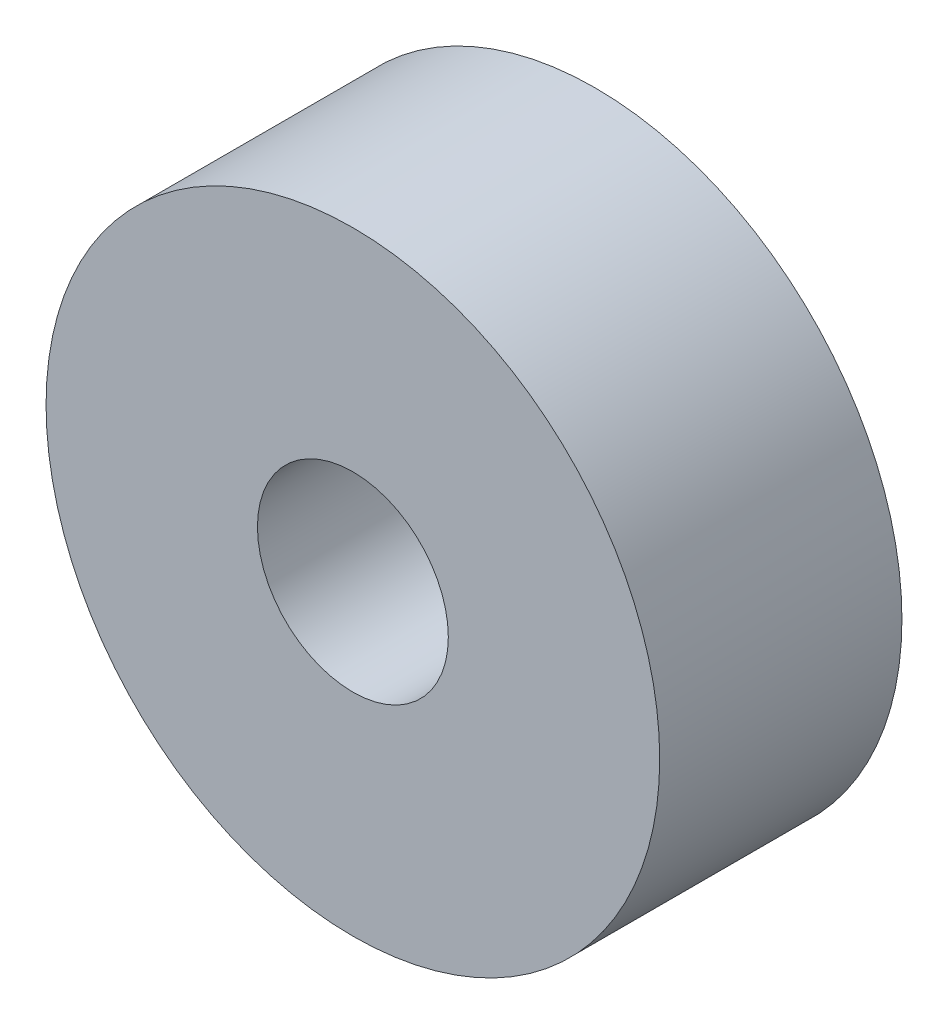
ISO-10303-21;
HEADER;
FILE_DESCRIPTION(('STEP AP214'),'2;1');
FILE_NAME('part.step','',(''),(''),'','','');
FILE_SCHEMA(('AUTOMOTIVE_DESIGN { 1 0 10303 214 1 1 1 1 }'));
ENDSEC;
DATA;
#1=APPLICATION_CONTEXT('core data for automotive mechanical design processes');
#2=APPLICATION_PROTOCOL_DEFINITION('international standard','automotive_design',2000,#1);
#3=PRODUCT_CONTEXT('',#1,'mechanical');
#4=PRODUCT('Part','Part','',(#3));
#5=PRODUCT_RELATED_PRODUCT_CATEGORY('part','',(#4));
#6=PRODUCT_DEFINITION_FORMATION('','',#4);
#7=PRODUCT_DEFINITION_CONTEXT('part definition',#1,'design');
#8=PRODUCT_DEFINITION('design','',#6,#7);
#9=PRODUCT_DEFINITION_SHAPE('','',#8);
#10=(LENGTH_UNIT() NAMED_UNIT(*) SI_UNIT(.MILLI.,.METRE.));
#11=(NAMED_UNIT(*) PLANE_ANGLE_UNIT() SI_UNIT($,.RADIAN.));
#12=(NAMED_UNIT(*) SI_UNIT($,.STERADIAN.) SOLID_ANGLE_UNIT());
#13=UNCERTAINTY_MEASURE_WITH_UNIT(LENGTH_MEASURE(1.E-05),#10,'distance_accuracy_value','');
#14=(GEOMETRIC_REPRESENTATION_CONTEXT(3) GLOBAL_UNCERTAINTY_ASSIGNED_CONTEXT((#13)) GLOBAL_UNIT_ASSIGNED_CONTEXT((#10,
#11,#12)) REPRESENTATION_CONTEXT('',''));
#15=CARTESIAN_POINT('',(0.,0.,0.));
#16=DIRECTION('',(0.,0.,1.));
#17=DIRECTION('',(1.,0.,0.));
#18=AXIS2_PLACEMENT_3D('',#15,#16,#17);
#19=CARTESIAN_POINT('',(0.,0.,7.5));
#20=DIRECTION('',(0.,0.,-1.));
#21=DIRECTION('',(-1.,0.,0.));
#22=AXIS2_PLACEMENT_3D('',#19,#20,#21);
#23=CYLINDRICAL_SURFACE('',#22,9.5);
#24=CARTESIAN_POINT('',(0.,0.,7.5));
#25=DIRECTION('',(0.,0.,1.));
#26=DIRECTION('',(1.,0.,0.));
#27=AXIS2_PLACEMENT_3D('',#24,#25,#26);
#28=CIRCLE('',#27,9.5);
#29=CARTESIAN_POINT('',(9.5,0.,7.5));
#30=VERTEX_POINT('',#29);
#31=EDGE_CURVE('E10',#30,#30,#28,.T.);
#32=ORIENTED_EDGE('',*,*,#31,.F.);
#33=EDGE_LOOP('',(#32));
#34=FACE_BOUND('',#33,.T.);
#35=CARTESIAN_POINT('',(0.,0.,0.));
#36=DIRECTION('',(0.,0.,1.));
#37=DIRECTION('',(1.,0.,0.));
#38=AXIS2_PLACEMENT_3D('',#35,#36,#37);
#39=CIRCLE('',#38,9.5);
#40=CARTESIAN_POINT('',(9.5,0.,0.));
#41=VERTEX_POINT('',#40);
#42=EDGE_CURVE('E38',#41,#41,#39,.T.);
#43=ORIENTED_EDGE('',*,*,#42,.T.);
#44=EDGE_LOOP('',(#43));
#45=FACE_BOUND('',#44,.T.);
#46=ADVANCED_FACE('F31',(#34,#45),#23,.T.);
#47=CARTESIAN_POINT('',(0.,0.,7.5));
#48=DIRECTION('',(0.,0.,1.));
#49=DIRECTION('',(1.,0.,0.));
#50=AXIS2_PLACEMENT_3D('',#47,#48,#49);
#51=PLANE('',#50);
#52=CARTESIAN_POINT('',(0.,0.,7.5));
#53=DIRECTION('',(0.,0.,1.));
#54=DIRECTION('',(1.,0.,0.));
#55=AXIS2_PLACEMENT_3D('',#52,#53,#54);
#56=CIRCLE('',#55,2.955);
#57=CARTESIAN_POINT('',(2.955,0.,7.5));
#58=VERTEX_POINT('',#57);
#59=EDGE_CURVE('E44',#58,#58,#56,.T.);
#60=ORIENTED_EDGE('',*,*,#59,.F.);
#61=EDGE_LOOP('',(#60));
#62=FACE_BOUND('',#61,.T.);
#63=ORIENTED_EDGE('',*,*,#31,.T.);
#64=EDGE_LOOP('',(#63));
#65=FACE_BOUND('',#64,.T.);
#66=ADVANCED_FACE('F60',(#62,#65),#51,.T.);
#67=CARTESIAN_POINT('',(0.,0.,0.));
#68=DIRECTION('',(0.,0.,1.));
#69=DIRECTION('',(1.,0.,0.));
#70=AXIS2_PLACEMENT_3D('',#67,#68,#69);
#71=PLANE('',#70);
#72=CARTESIAN_POINT('',(0.,0.,0.));
#73=DIRECTION('',(0.,0.,1.));
#74=DIRECTION('',(1.,0.,0.));
#75=AXIS2_PLACEMENT_3D('',#72,#73,#74);
#76=CIRCLE('',#75,2.955);
#77=CARTESIAN_POINT('',(2.955,0.,0.));
#78=VERTEX_POINT('',#77);
#79=EDGE_CURVE('E34',#78,#78,#76,.T.);
#80=ORIENTED_EDGE('',*,*,#79,.T.);
#81=EDGE_LOOP('',(#80));
#82=FACE_BOUND('',#81,.T.);
#83=ORIENTED_EDGE('',*,*,#42,.F.);
#84=EDGE_LOOP('',(#83));
#85=FACE_BOUND('',#84,.T.);
#86=ADVANCED_FACE('F51',(#82,#85),#71,.F.);
#87=CARTESIAN_POINT('',(0.,0.,-2.5));
#88=DIRECTION('',(0.,0.,1.));
#89=DIRECTION('',(1.,0.,0.));
#90=AXIS2_PLACEMENT_3D('',#87,#88,#89);
#91=CYLINDRICAL_SURFACE('',#90,2.955);
#92=ORIENTED_EDGE('',*,*,#59,.T.);
#93=EDGE_LOOP('',(#92));
#94=FACE_BOUND('',#93,.T.);
#95=ORIENTED_EDGE('',*,*,#79,.F.);
#96=EDGE_LOOP('',(#95));
#97=FACE_BOUND('',#96,.T.);
#98=ADVANCED_FACE('F54',(#94,#97),#91,.F.);
#99=CLOSED_SHELL('',(#46,#66,#86,#98));
#100=MANIFOLD_SOLID_BREP('B2',#99);
#101=ADVANCED_BREP_SHAPE_REPRESENTATION('',(#18,#100),#14);
#102=SHAPE_DEFINITION_REPRESENTATION(#9,#101);
ENDSEC;
END-ISO-10303-21;
